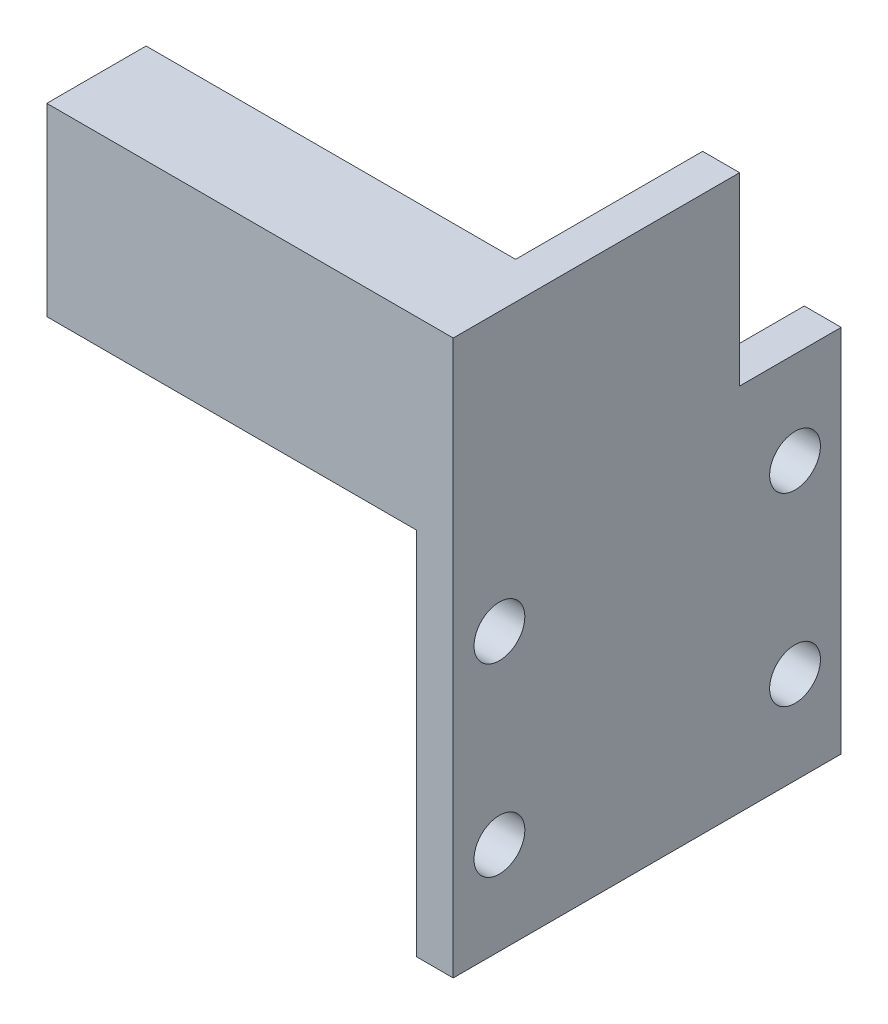
ISO-10303-21;
HEADER;
FILE_DESCRIPTION(('STEP AP214'),'2;1');
FILE_NAME('part.step','',(''),(''),'','','');
FILE_SCHEMA(('AUTOMOTIVE_DESIGN { 1 0 10303 214 1 1 1 1 }'));
ENDSEC;
DATA;
#1=APPLICATION_CONTEXT('core data for automotive mechanical design processes');
#2=APPLICATION_PROTOCOL_DEFINITION('international standard','automotive_design',2000,#1);
#3=PRODUCT_CONTEXT('',#1,'mechanical');
#4=PRODUCT('Part','Part','',(#3));
#5=PRODUCT_RELATED_PRODUCT_CATEGORY('part','',(#4));
#6=PRODUCT_DEFINITION_FORMATION('','',#4);
#7=PRODUCT_DEFINITION_CONTEXT('part definition',#1,'design');
#8=PRODUCT_DEFINITION('design','',#6,#7);
#9=PRODUCT_DEFINITION_SHAPE('','',#8);
#10=(LENGTH_UNIT() NAMED_UNIT(*) SI_UNIT(.MILLI.,.METRE.));
#11=(NAMED_UNIT(*) PLANE_ANGLE_UNIT() SI_UNIT($,.RADIAN.));
#12=(NAMED_UNIT(*) SI_UNIT($,.STERADIAN.) SOLID_ANGLE_UNIT());
#13=UNCERTAINTY_MEASURE_WITH_UNIT(LENGTH_MEASURE(1.E-05),#10,'distance_accuracy_value','');
#14=(GEOMETRIC_REPRESENTATION_CONTEXT(3) GLOBAL_UNCERTAINTY_ASSIGNED_CONTEXT((#13)) GLOBAL_UNIT_ASSIGNED_CONTEXT((#10,
#11,#12)) REPRESENTATION_CONTEXT('',''));
#15=CARTESIAN_POINT('',(0.,0.,0.));
#16=DIRECTION('',(0.,0.,1.));
#17=DIRECTION('',(1.,0.,0.));
#18=AXIS2_PLACEMENT_3D('',#15,#16,#17);
#19=CARTESIAN_POINT('',(-4.,0.,0.));
#20=DIRECTION('',(0.,0.,1.));
#21=DIRECTION('',(1.,0.,0.));
#22=AXIS2_PLACEMENT_3D('',#19,#20,#21);
#23=PLANE('',#22);
#24=DIRECTION('',(0.,-1.,0.));
#25=VECTOR('',#24,1.);
#26=CARTESIAN_POINT('',(0.,0.,0.));
#27=LINE('',#26,#25);
#28=CARTESIAN_POINT('',(0.,60.,0.));
#29=VERTEX_POINT('',#28);
#30=CARTESIAN_POINT('',(0.,0.,0.));
#31=VERTEX_POINT('',#30);
#32=EDGE_CURVE('E161',#29,#31,#27,.T.);
#33=ORIENTED_EDGE('',*,*,#32,.F.);
#34=DIRECTION('',(1.,0.,0.));
#35=VECTOR('',#34,1.);
#36=CARTESIAN_POINT('',(-44.,60.,0.));
#37=LINE('',#36,#35);
#38=CARTESIAN_POINT('',(-44.,60.,0.));
#39=VERTEX_POINT('',#38);
#40=EDGE_CURVE('E195',#39,#29,#37,.T.);
#41=ORIENTED_EDGE('',*,*,#40,.F.);
#42=DIRECTION('',(0.,-1.,0.));
#43=VECTOR('',#42,1.);
#44=CARTESIAN_POINT('',(-44.,60.,0.));
#45=LINE('',#44,#43);
#46=CARTESIAN_POINT('',(-44.,40.,0.));
#47=VERTEX_POINT('',#46);
#48=EDGE_CURVE('E197',#39,#47,#45,.T.);
#49=ORIENTED_EDGE('',*,*,#48,.T.);
#50=DIRECTION('',(1.,0.,0.));
#51=VECTOR('',#50,1.);
#52=CARTESIAN_POINT('',(-44.,40.,0.));
#53=LINE('',#52,#51);
#54=CARTESIAN_POINT('',(-4.,40.,0.));
#55=VERTEX_POINT('',#54);
#56=EDGE_CURVE('E131',#47,#55,#53,.T.);
#57=ORIENTED_EDGE('',*,*,#56,.T.);
#58=DIRECTION('',(0.,-1.,0.));
#59=VECTOR('',#58,1.);
#60=CARTESIAN_POINT('',(-4.,0.,0.));
#61=LINE('',#60,#59);
#62=CARTESIAN_POINT('',(-4.,0.,0.));
#63=VERTEX_POINT('',#62);
#64=EDGE_CURVE('E164',#55,#63,#61,.T.);
#65=ORIENTED_EDGE('',*,*,#64,.T.);
#66=DIRECTION('',(1.,0.,0.));
#67=VECTOR('',#66,1.);
#68=CARTESIAN_POINT('',(-4.,0.,0.));
#69=LINE('',#68,#67);
#70=EDGE_CURVE('E43',#63,#31,#69,.T.);
#71=ORIENTED_EDGE('',*,*,#70,.T.);
#72=EDGE_LOOP('',(#33,#41,#49,#57,#65,#71));
#73=FACE_BOUND('',#72,.T.);
#74=ADVANCED_FACE('F40',(#73),#23,.T.);
#75=CARTESIAN_POINT('',(-4.,40.,0.));
#76=DIRECTION('',(0.,1.,0.));
#77=DIRECTION('',(0.,0.,1.));
#78=AXIS2_PLACEMENT_3D('',#75,#76,#77);
#79=PLANE('',#78);
#80=DIRECTION('',(-1.,0.,0.));
#81=VECTOR('',#80,1.);
#82=CARTESIAN_POINT('',(-4.,40.,-31.));
#83=LINE('',#82,#81);
#84=CARTESIAN_POINT('',(0.,40.,-31.));
#85=VERTEX_POINT('',#84);
#86=CARTESIAN_POINT('',(-4.,40.,-31.));
#87=VERTEX_POINT('',#86);
#88=EDGE_CURVE('E64',#85,#87,#83,.T.);
#89=ORIENTED_EDGE('',*,*,#88,.F.);
#90=DIRECTION('',(0.,0.,1.));
#91=VECTOR('',#90,1.);
#92=CARTESIAN_POINT('',(0.,40.,0.));
#93=LINE('',#92,#91);
#94=CARTESIAN_POINT('',(0.,40.,-42.));
#95=VERTEX_POINT('',#94);
#96=EDGE_CURVE('E168',#95,#85,#93,.T.);
#97=ORIENTED_EDGE('',*,*,#96,.F.);
#98=DIRECTION('',(1.,0.,0.));
#99=VECTOR('',#98,1.);
#100=CARTESIAN_POINT('',(-4.,40.,-42.));
#101=LINE('',#100,#99);
#102=CARTESIAN_POINT('',(-4.,40.,-42.));
#103=VERTEX_POINT('',#102);
#104=EDGE_CURVE('E11',#103,#95,#101,.T.);
#105=ORIENTED_EDGE('',*,*,#104,.F.);
#106=DIRECTION('',(0.,0.,1.));
#107=VECTOR('',#106,1.);
#108=CARTESIAN_POINT('',(-4.,40.,0.));
#109=LINE('',#108,#107);
#110=EDGE_CURVE('E174',#103,#87,#109,.T.);
#111=ORIENTED_EDGE('',*,*,#110,.T.);
#112=EDGE_LOOP('',(#89,#97,#105,#111));
#113=FACE_BOUND('',#112,.T.);
#114=ADVANCED_FACE('F233',(#113),#79,.T.);
#115=CARTESIAN_POINT('',(-4.,0.,-42.));
#116=DIRECTION('',(0.,0.,-1.));
#117=DIRECTION('',(-1.,0.,0.));
#118=AXIS2_PLACEMENT_3D('',#115,#116,#117);
#119=PLANE('',#118);
#120=DIRECTION('',(0.,1.,0.));
#121=VECTOR('',#120,1.);
#122=CARTESIAN_POINT('',(0.,0.,-42.));
#123=LINE('',#122,#121);
#124=CARTESIAN_POINT('',(0.,0.,-42.));
#125=VERTEX_POINT('',#124);
#126=EDGE_CURVE('E181',#125,#95,#123,.T.);
#127=ORIENTED_EDGE('',*,*,#126,.F.);
#128=DIRECTION('',(1.,0.,0.));
#129=VECTOR('',#128,1.);
#130=CARTESIAN_POINT('',(-4.,0.,-42.));
#131=LINE('',#130,#129);
#132=CARTESIAN_POINT('',(-4.,0.,-42.));
#133=VERTEX_POINT('',#132);
#134=EDGE_CURVE('E48',#133,#125,#131,.T.);
#135=ORIENTED_EDGE('',*,*,#134,.F.);
#136=DIRECTION('',(0.,1.,0.));
#137=VECTOR('',#136,1.);
#138=CARTESIAN_POINT('',(-4.,0.,-42.));
#139=LINE('',#138,#137);
#140=EDGE_CURVE('E171',#133,#103,#139,.T.);
#141=ORIENTED_EDGE('',*,*,#140,.T.);
#142=ORIENTED_EDGE('',*,*,#104,.T.);
#143=EDGE_LOOP('',(#127,#135,#141,#142));
#144=FACE_BOUND('',#143,.T.);
#145=ADVANCED_FACE('F238',(#144),#119,.T.);
#146=CARTESIAN_POINT('',(-4.,0.,0.));
#147=DIRECTION('',(0.,-1.,0.));
#148=DIRECTION('',(0.,0.,-1.));
#149=AXIS2_PLACEMENT_3D('',#146,#147,#148);
#150=PLANE('',#149);
#151=DIRECTION('',(0.,0.,-1.));
#152=VECTOR('',#151,1.);
#153=CARTESIAN_POINT('',(0.,0.,0.));
#154=LINE('',#153,#152);
#155=EDGE_CURVE('E178',#31,#125,#154,.T.);
#156=ORIENTED_EDGE('',*,*,#155,.F.);
#157=ORIENTED_EDGE('',*,*,#70,.F.);
#158=DIRECTION('',(0.,0.,-1.));
#159=VECTOR('',#158,1.);
#160=CARTESIAN_POINT('',(-4.,0.,0.));
#161=LINE('',#160,#159);
#162=EDGE_CURVE('E167',#63,#133,#161,.T.);
#163=ORIENTED_EDGE('',*,*,#162,.T.);
#164=ORIENTED_EDGE('',*,*,#134,.T.);
#165=EDGE_LOOP('',(#156,#157,#163,#164));
#166=FACE_BOUND('',#165,.T.);
#167=ADVANCED_FACE('F191',(#166),#150,.T.);
#168=CARTESIAN_POINT('',(-4.,0.,0.));
#169=DIRECTION('',(-1.,0.,0.));
#170=DIRECTION('',(0.,0.,1.));
#171=AXIS2_PLACEMENT_3D('',#168,#169,#170);
#172=PLANE('',#171);
#173=CARTESIAN_POINT('',(-4.,30.,-37.));
#174=DIRECTION('',(1.,0.,0.));
#175=DIRECTION('',(0.,0.,1.));
#176=AXIS2_PLACEMENT_3D('',#173,#174,#175);
#177=CIRCLE('',#176,2.75);
#178=CARTESIAN_POINT('',(-4.,30.,-34.25));
#179=VERTEX_POINT('',#178);
#180=EDGE_CURVE('E137',#179,#179,#177,.T.);
#181=ORIENTED_EDGE('',*,*,#180,.T.);
#182=EDGE_LOOP('',(#181));
#183=FACE_BOUND('',#182,.T.);
#184=CARTESIAN_POINT('',(-4.,10.,-37.));
#185=DIRECTION('',(1.,0.,0.));
#186=DIRECTION('',(0.,0.,-1.));
#187=AXIS2_PLACEMENT_3D('',#184,#185,#186);
#188=CIRCLE('',#187,2.75);
#189=CARTESIAN_POINT('',(-4.,10.,-39.75));
#190=VERTEX_POINT('',#189);
#191=EDGE_CURVE('E146',#190,#190,#188,.T.);
#192=ORIENTED_EDGE('',*,*,#191,.T.);
#193=EDGE_LOOP('',(#192));
#194=FACE_BOUND('',#193,.T.);
#195=CARTESIAN_POINT('',(-4.,10.,-5.));
#196=DIRECTION('',(1.,0.,0.));
#197=DIRECTION('',(0.,0.,1.));
#198=AXIS2_PLACEMENT_3D('',#195,#196,#197);
#199=CIRCLE('',#198,2.75);
#200=CARTESIAN_POINT('',(-4.,10.,-2.25));
#201=VERTEX_POINT('',#200);
#202=EDGE_CURVE('E152',#201,#201,#199,.T.);
#203=ORIENTED_EDGE('',*,*,#202,.T.);
#204=EDGE_LOOP('',(#203));
#205=FACE_BOUND('',#204,.T.);
#206=CARTESIAN_POINT('',(-4.,30.,-5.));
#207=DIRECTION('',(1.,0.,0.));
#208=DIRECTION('',(0.,0.,-1.));
#209=AXIS2_PLACEMENT_3D('',#206,#207,#208);
#210=CIRCLE('',#209,2.75);
#211=CARTESIAN_POINT('',(-4.,30.,-7.75));
#212=VERTEX_POINT('',#211);
#213=EDGE_CURVE('E158',#212,#212,#210,.T.);
#214=ORIENTED_EDGE('',*,*,#213,.T.);
#215=EDGE_LOOP('',(#214));
#216=FACE_BOUND('',#215,.T.);
#217=ORIENTED_EDGE('',*,*,#64,.F.);
#218=CARTESIAN_POINT('',(-4.,40.,-10.75));
#219=VERTEX_POINT('',#218);
#220=EDGE_CURVE('E56',#219,#55,#109,.T.);
#221=ORIENTED_EDGE('',*,*,#220,.F.);
#222=DIRECTION('',(0.,-1.,0.));
#223=VECTOR('',#222,1.);
#224=CARTESIAN_POINT('',(-4.,60.,-10.75));
#225=LINE('',#224,#223);
#226=CARTESIAN_POINT('',(-4.,60.,-10.75));
#227=VERTEX_POINT('',#226);
#228=EDGE_CURVE('E117',#227,#219,#225,.T.);
#229=ORIENTED_EDGE('',*,*,#228,.F.);
#230=DIRECTION('',(0.,0.,1.));
#231=VECTOR('',#230,1.);
#232=CARTESIAN_POINT('',(-4.,60.,-31.));
#233=LINE('',#232,#231);
#234=CARTESIAN_POINT('',(-4.,60.,-31.));
#235=VERTEX_POINT('',#234);
#236=EDGE_CURVE('E111',#235,#227,#233,.T.);
#237=ORIENTED_EDGE('',*,*,#236,.F.);
#238=DIRECTION('',(0.,-1.,0.));
#239=VECTOR('',#238,1.);
#240=CARTESIAN_POINT('',(-4.,60.,-31.));
#241=LINE('',#240,#239);
#242=EDGE_CURVE('E116',#235,#87,#241,.T.);
#243=ORIENTED_EDGE('',*,*,#242,.T.);
#244=ORIENTED_EDGE('',*,*,#110,.F.);
#245=ORIENTED_EDGE('',*,*,#140,.F.);
#246=ORIENTED_EDGE('',*,*,#162,.F.);
#247=EDGE_LOOP('',(#217,#221,#229,#237,#243,#244,#245,#246));
#248=FACE_BOUND('',#247,.T.);
#249=ADVANCED_FACE('F113',(#183,#194,#205,#216,#248),#172,.T.);
#250=CARTESIAN_POINT('',(0.,0.,0.));
#251=DIRECTION('',(-1.,0.,0.));
#252=DIRECTION('',(0.,0.,1.));
#253=AXIS2_PLACEMENT_3D('',#250,#251,#252);
#254=PLANE('',#253);
#255=CARTESIAN_POINT('',(0.,30.,-37.));
#256=DIRECTION('',(1.,0.,0.));
#257=DIRECTION('',(0.,0.,1.));
#258=AXIS2_PLACEMENT_3D('',#255,#256,#257);
#259=CIRCLE('',#258,2.75);
#260=CARTESIAN_POINT('',(0.,30.,-34.25));
#261=VERTEX_POINT('',#260);
#262=EDGE_CURVE('E134',#261,#261,#259,.T.);
#263=ORIENTED_EDGE('',*,*,#262,.F.);
#264=EDGE_LOOP('',(#263));
#265=FACE_BOUND('',#264,.T.);
#266=CARTESIAN_POINT('',(0.,10.,-37.));
#267=DIRECTION('',(1.,0.,0.));
#268=DIRECTION('',(0.,0.,-1.));
#269=AXIS2_PLACEMENT_3D('',#266,#267,#268);
#270=CIRCLE('',#269,2.75);
#271=CARTESIAN_POINT('',(0.,10.,-39.75));
#272=VERTEX_POINT('',#271);
#273=EDGE_CURVE('E144',#272,#272,#270,.T.);
#274=ORIENTED_EDGE('',*,*,#273,.F.);
#275=EDGE_LOOP('',(#274));
#276=FACE_BOUND('',#275,.T.);
#277=CARTESIAN_POINT('',(0.,10.,-5.));
#278=DIRECTION('',(1.,0.,0.));
#279=DIRECTION('',(0.,0.,1.));
#280=AXIS2_PLACEMENT_3D('',#277,#278,#279);
#281=CIRCLE('',#280,2.75);
#282=CARTESIAN_POINT('',(0.,10.,-2.25));
#283=VERTEX_POINT('',#282);
#284=EDGE_CURVE('E149',#283,#283,#281,.T.);
#285=ORIENTED_EDGE('',*,*,#284,.F.);
#286=EDGE_LOOP('',(#285));
#287=FACE_BOUND('',#286,.T.);
#288=CARTESIAN_POINT('',(0.,30.,-5.));
#289=DIRECTION('',(1.,0.,0.));
#290=DIRECTION('',(0.,0.,-1.));
#291=AXIS2_PLACEMENT_3D('',#288,#289,#290);
#292=CIRCLE('',#291,2.75);
#293=CARTESIAN_POINT('',(0.,30.,-7.75));
#294=VERTEX_POINT('',#293);
#295=EDGE_CURVE('E155',#294,#294,#292,.T.);
#296=ORIENTED_EDGE('',*,*,#295,.F.);
#297=EDGE_LOOP('',(#296));
#298=FACE_BOUND('',#297,.T.);
#299=ORIENTED_EDGE('',*,*,#32,.T.);
#300=ORIENTED_EDGE('',*,*,#155,.T.);
#301=ORIENTED_EDGE('',*,*,#126,.T.);
#302=ORIENTED_EDGE('',*,*,#96,.T.);
#303=DIRECTION('',(0.,-1.,0.));
#304=VECTOR('',#303,1.);
#305=CARTESIAN_POINT('',(0.,60.,-31.));
#306=LINE('',#305,#304);
#307=CARTESIAN_POINT('',(0.,60.,-31.));
#308=VERTEX_POINT('',#307);
#309=EDGE_CURVE('E194',#308,#85,#306,.T.);
#310=ORIENTED_EDGE('',*,*,#309,.F.);
#311=DIRECTION('',(0.,0.,-1.));
#312=VECTOR('',#311,1.);
#313=CARTESIAN_POINT('',(0.,60.,0.));
#314=LINE('',#313,#312);
#315=EDGE_CURVE('E127',#29,#308,#314,.T.);
#316=ORIENTED_EDGE('',*,*,#315,.F.);
#317=EDGE_LOOP('',(#299,#300,#301,#302,#310,#316));
#318=FACE_BOUND('',#317,.T.);
#319=ADVANCED_FACE('F193',(#265,#276,#287,#298,#318),#254,.F.);
#320=CARTESIAN_POINT('',(-4.,30.,-5.));
#321=DIRECTION('',(1.,0.,0.));
#322=DIRECTION('',(0.,0.,-1.));
#323=AXIS2_PLACEMENT_3D('',#320,#321,#322);
#324=CYLINDRICAL_SURFACE('',#323,2.75);
#325=ORIENTED_EDGE('',*,*,#213,.F.);
#326=EDGE_LOOP('',(#325));
#327=FACE_BOUND('',#326,.T.);
#328=ORIENTED_EDGE('',*,*,#295,.T.);
#329=EDGE_LOOP('',(#328));
#330=FACE_BOUND('',#329,.T.);
#331=ADVANCED_FACE('F256',(#327,#330),#324,.F.);
#332=CARTESIAN_POINT('',(-4.,10.,-5.));
#333=DIRECTION('',(1.,0.,0.));
#334=DIRECTION('',(0.,0.,-1.));
#335=AXIS2_PLACEMENT_3D('',#332,#333,#334);
#336=CYLINDRICAL_SURFACE('',#335,2.75);
#337=ORIENTED_EDGE('',*,*,#202,.F.);
#338=EDGE_LOOP('',(#337));
#339=FACE_BOUND('',#338,.T.);
#340=ORIENTED_EDGE('',*,*,#284,.T.);
#341=EDGE_LOOP('',(#340));
#342=FACE_BOUND('',#341,.T.);
#343=ADVANCED_FACE('F261',(#339,#342),#336,.F.);
#344=CARTESIAN_POINT('',(-4.,10.,-37.));
#345=DIRECTION('',(1.,0.,0.));
#346=DIRECTION('',(0.,0.,-1.));
#347=AXIS2_PLACEMENT_3D('',#344,#345,#346);
#348=CYLINDRICAL_SURFACE('',#347,2.75);
#349=ORIENTED_EDGE('',*,*,#191,.F.);
#350=EDGE_LOOP('',(#349));
#351=FACE_BOUND('',#350,.T.);
#352=ORIENTED_EDGE('',*,*,#273,.T.);
#353=EDGE_LOOP('',(#352));
#354=FACE_BOUND('',#353,.T.);
#355=ADVANCED_FACE('F265',(#351,#354),#348,.F.);
#356=CARTESIAN_POINT('',(-4.,30.,-37.));
#357=DIRECTION('',(1.,0.,0.));
#358=DIRECTION('',(0.,0.,-1.));
#359=AXIS2_PLACEMENT_3D('',#356,#357,#358);
#360=CYLINDRICAL_SURFACE('',#359,2.75);
#361=ORIENTED_EDGE('',*,*,#180,.F.);
#362=EDGE_LOOP('',(#361));
#363=FACE_BOUND('',#362,.T.);
#364=ORIENTED_EDGE('',*,*,#262,.T.);
#365=EDGE_LOOP('',(#364));
#366=FACE_BOUND('',#365,.T.);
#367=ADVANCED_FACE('F269',(#363,#366),#360,.F.);
#368=CARTESIAN_POINT('',(0.,40.,0.));
#369=DIRECTION('',(0.,1.,0.));
#370=DIRECTION('',(0.,0.,1.));
#371=AXIS2_PLACEMENT_3D('',#368,#369,#370);
#372=PLANE('',#371);
#373=DIRECTION('',(-1.,0.,0.));
#374=VECTOR('',#373,1.);
#375=CARTESIAN_POINT('',(-4.,40.,-10.75));
#376=LINE('',#375,#374);
#377=CARTESIAN_POINT('',(-44.,40.,-10.75));
#378=VERTEX_POINT('',#377);
#379=EDGE_CURVE('E204',#219,#378,#376,.T.);
#380=ORIENTED_EDGE('',*,*,#379,.F.);
#381=ORIENTED_EDGE('',*,*,#220,.T.);
#382=ORIENTED_EDGE('',*,*,#56,.F.);
#383=DIRECTION('',(0.,0.,1.));
#384=VECTOR('',#383,1.);
#385=CARTESIAN_POINT('',(-44.,40.,-10.75));
#386=LINE('',#385,#384);
#387=EDGE_CURVE('E206',#378,#47,#386,.T.);
#388=ORIENTED_EDGE('',*,*,#387,.F.);
#389=EDGE_LOOP('',(#380,#381,#382,#388));
#390=FACE_BOUND('',#389,.T.);
#391=ADVANCED_FACE('F221',(#390),#372,.F.);
#392=CARTESIAN_POINT('',(-4.,60.,-31.));
#393=DIRECTION('',(0.,0.,1.));
#394=DIRECTION('',(1.,0.,0.));
#395=AXIS2_PLACEMENT_3D('',#392,#393,#394);
#396=PLANE('',#395);
#397=ORIENTED_EDGE('',*,*,#88,.T.);
#398=ORIENTED_EDGE('',*,*,#242,.F.);
#399=DIRECTION('',(-1.,0.,0.));
#400=VECTOR('',#399,1.);
#401=CARTESIAN_POINT('',(-4.,60.,-31.));
#402=LINE('',#401,#400);
#403=EDGE_CURVE('E121',#308,#235,#402,.T.);
#404=ORIENTED_EDGE('',*,*,#403,.F.);
#405=ORIENTED_EDGE('',*,*,#309,.T.);
#406=EDGE_LOOP('',(#397,#398,#404,#405));
#407=FACE_BOUND('',#406,.T.);
#408=ADVANCED_FACE('F133',(#407),#396,.F.);
#409=CARTESIAN_POINT('',(-4.,60.,-10.75));
#410=DIRECTION('',(0.,0.,1.));
#411=DIRECTION('',(1.,0.,0.));
#412=AXIS2_PLACEMENT_3D('',#409,#410,#411);
#413=PLANE('',#412);
#414=ORIENTED_EDGE('',*,*,#379,.T.);
#415=DIRECTION('',(0.,-1.,0.));
#416=VECTOR('',#415,1.);
#417=CARTESIAN_POINT('',(-44.,60.,-10.75));
#418=LINE('',#417,#416);
#419=CARTESIAN_POINT('',(-44.,60.,-10.75));
#420=VERTEX_POINT('',#419);
#421=EDGE_CURVE('E139',#420,#378,#418,.T.);
#422=ORIENTED_EDGE('',*,*,#421,.F.);
#423=DIRECTION('',(-1.,0.,0.));
#424=VECTOR('',#423,1.);
#425=CARTESIAN_POINT('',(-4.,60.,-10.75));
#426=LINE('',#425,#424);
#427=EDGE_CURVE('E120',#227,#420,#426,.T.);
#428=ORIENTED_EDGE('',*,*,#427,.F.);
#429=ORIENTED_EDGE('',*,*,#228,.T.);
#430=EDGE_LOOP('',(#414,#422,#428,#429));
#431=FACE_BOUND('',#430,.T.);
#432=ADVANCED_FACE('F223',(#431),#413,.F.);
#433=CARTESIAN_POINT('',(-44.,60.,-10.75));
#434=DIRECTION('',(1.,0.,0.));
#435=DIRECTION('',(0.,0.,-1.));
#436=AXIS2_PLACEMENT_3D('',#433,#434,#435);
#437=PLANE('',#436);
#438=ORIENTED_EDGE('',*,*,#387,.T.);
#439=ORIENTED_EDGE('',*,*,#48,.F.);
#440=DIRECTION('',(0.,0.,1.));
#441=VECTOR('',#440,1.);
#442=CARTESIAN_POINT('',(-44.,60.,-10.75));
#443=LINE('',#442,#441);
#444=EDGE_CURVE('E199',#420,#39,#443,.T.);
#445=ORIENTED_EDGE('',*,*,#444,.F.);
#446=ORIENTED_EDGE('',*,*,#421,.T.);
#447=EDGE_LOOP('',(#438,#439,#445,#446));
#448=FACE_BOUND('',#447,.T.);
#449=ADVANCED_FACE('F215',(#448),#437,.F.);
#450=CARTESIAN_POINT('',(0.,60.,0.));
#451=DIRECTION('',(0.,1.,0.));
#452=DIRECTION('',(0.,0.,1.));
#453=AXIS2_PLACEMENT_3D('',#450,#451,#452);
#454=PLANE('',#453);
#455=ORIENTED_EDGE('',*,*,#403,.T.);
#456=ORIENTED_EDGE('',*,*,#236,.T.);
#457=ORIENTED_EDGE('',*,*,#427,.T.);
#458=ORIENTED_EDGE('',*,*,#444,.T.);
#459=ORIENTED_EDGE('',*,*,#40,.T.);
#460=ORIENTED_EDGE('',*,*,#315,.T.);
#461=EDGE_LOOP('',(#455,#456,#457,#458,#459,#460));
#462=FACE_BOUND('',#461,.T.);
#463=ADVANCED_FACE('F124',(#462),#454,.T.);
#464=CLOSED_SHELL('',(#74,#114,#145,#167,#249,#319,#331,#343,#355,#367,#391,#408,#432,#449,#463));
#465=MANIFOLD_SOLID_BREP('B2',#464);
#466=ADVANCED_BREP_SHAPE_REPRESENTATION('',(#18,#465),#14);
#467=SHAPE_DEFINITION_REPRESENTATION(#9,#466);
ENDSEC;
END-ISO-10303-21;
